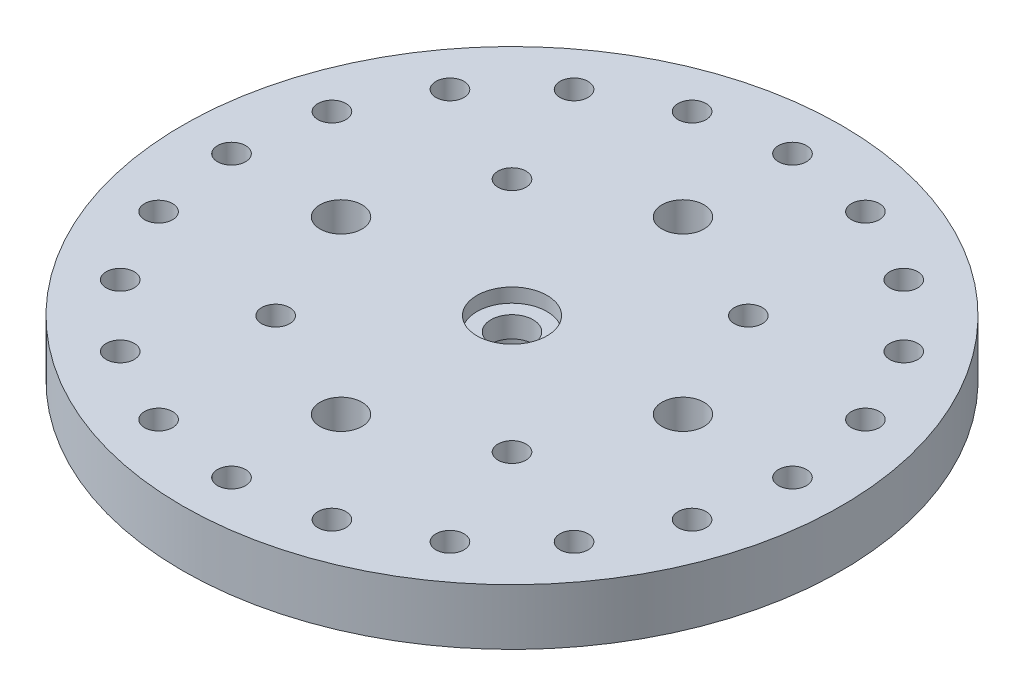
ISO-10303-21;
HEADER;
FILE_DESCRIPTION(('STEP AP214'),'2;1');
FILE_NAME('part.step','',(''),(''),'','','');
FILE_SCHEMA(('AUTOMOTIVE_DESIGN { 1 0 10303 214 1 1 1 1 }'));
ENDSEC;
DATA;
#1=APPLICATION_CONTEXT('core data for automotive mechanical design processes');
#2=APPLICATION_PROTOCOL_DEFINITION('international standard','automotive_design',2000,#1);
#3=PRODUCT_CONTEXT('',#1,'mechanical');
#4=PRODUCT('Part','Part','',(#3));
#5=PRODUCT_RELATED_PRODUCT_CATEGORY('part','',(#4));
#6=PRODUCT_DEFINITION_FORMATION('','',#4);
#7=PRODUCT_DEFINITION_CONTEXT('part definition',#1,'design');
#8=PRODUCT_DEFINITION('design','',#6,#7);
#9=PRODUCT_DEFINITION_SHAPE('','',#8);
#10=(LENGTH_UNIT() NAMED_UNIT(*) SI_UNIT(.MILLI.,.METRE.));
#11=(NAMED_UNIT(*) PLANE_ANGLE_UNIT() SI_UNIT($,.RADIAN.));
#12=(NAMED_UNIT(*) SI_UNIT($,.STERADIAN.) SOLID_ANGLE_UNIT());
#13=UNCERTAINTY_MEASURE_WITH_UNIT(LENGTH_MEASURE(1.E-05),#10,'distance_accuracy_value','');
#14=(GEOMETRIC_REPRESENTATION_CONTEXT(3) GLOBAL_UNCERTAINTY_ASSIGNED_CONTEXT((#13)) GLOBAL_UNIT_ASSIGNED_CONTEXT((#10,
#11,#12)) REPRESENTATION_CONTEXT('',''));
#15=CARTESIAN_POINT('',(0.,0.,0.));
#16=DIRECTION('',(0.,0.,1.));
#17=DIRECTION('',(1.,0.,0.));
#18=AXIS2_PLACEMENT_3D('',#15,#16,#17);
#19=CARTESIAN_POINT('',(0.,0.,0.));
#20=DIRECTION('',(0.,1.,0.));
#21=DIRECTION('',(0.,0.,1.));
#22=AXIS2_PLACEMENT_3D('',#19,#20,#21);
#23=PLANE('',#22);
#24=CARTESIAN_POINT('',(-8.42553379972618,0.,8.4255337997258));
#25=DIRECTION('',(0.,1.,0.));
#26=DIRECTION('',(0.,0.,1.));
#27=AXIS2_PLACEMENT_3D('',#24,#25,#26);
#28=CIRCLE('',#27,1.);
#29=CARTESIAN_POINT('',(-8.42553379972618,0.,9.4255337997258));
#30=VERTEX_POINT('',#29);
#31=EDGE_CURVE('E71',#30,#30,#28,.T.);
#32=ORIENTED_EDGE('',*,*,#31,.T.);
#33=EDGE_LOOP('',(#32));
#34=FACE_BOUND('',#33,.T.);
#35=CARTESIAN_POINT('',(8.42553379972583,0.,8.42553379972615));
#36=DIRECTION('',(0.,1.,0.));
#37=DIRECTION('',(0.,0.,1.));
#38=AXIS2_PLACEMENT_3D('',#35,#36,#37);
#39=CIRCLE('',#38,1.);
#40=CARTESIAN_POINT('',(8.42553379972583,0.,9.42553379972615));
#41=VERTEX_POINT('',#40);
#42=EDGE_CURVE('E94',#41,#41,#39,.T.);
#43=ORIENTED_EDGE('',*,*,#42,.T.);
#44=EDGE_LOOP('',(#43));
#45=FACE_BOUND('',#44,.T.);
#46=CARTESIAN_POINT('',(8.42553379972613,0.,-8.42553379972586));
#47=DIRECTION('',(0.,1.,0.));
#48=DIRECTION('',(0.,0.,1.));
#49=AXIS2_PLACEMENT_3D('',#46,#47,#48);
#50=CIRCLE('',#49,1.);
#51=CARTESIAN_POINT('',(8.42553379972613,0.,-7.42553379972586));
#52=VERTEX_POINT('',#51);
#53=EDGE_CURVE('E100',#52,#52,#50,.T.);
#54=ORIENTED_EDGE('',*,*,#53,.T.);
#55=EDGE_LOOP('',(#54));
#56=FACE_BOUND('',#55,.T.);
#57=CARTESIAN_POINT('',(-12.1919309783954,0.,-1.27703698486593E-13));
#58=DIRECTION('',(0.,1.,0.));
#59=DIRECTION('',(0.,0.,1.));
#60=AXIS2_PLACEMENT_3D('',#57,#58,#59);
#61=CIRCLE('',#60,1.5);
#62=CARTESIAN_POINT('',(-12.1919309783954,0.,1.49999999999987));
#63=VERTEX_POINT('',#62);
#64=EDGE_CURVE('E106',#63,#63,#61,.T.);
#65=ORIENTED_EDGE('',*,*,#64,.T.);
#66=EDGE_LOOP('',(#65));
#67=FACE_BOUND('',#66,.T.);
#68=CARTESIAN_POINT('',(0.,0.,12.1919309783954));
#69=DIRECTION('',(0.,1.,0.));
#70=DIRECTION('',(0.,0.,1.));
#71=AXIS2_PLACEMENT_3D('',#68,#69,#70);
#72=CIRCLE('',#71,1.5);
#73=CARTESIAN_POINT('',(0.,0.,13.6919309783954));
#74=VERTEX_POINT('',#73);
#75=EDGE_CURVE('E112',#74,#74,#72,.T.);
#76=ORIENTED_EDGE('',*,*,#75,.T.);
#77=EDGE_LOOP('',(#76));
#78=FACE_BOUND('',#77,.T.);
#79=CARTESIAN_POINT('',(12.1919309783954,0.,0.));
#80=DIRECTION('',(0.,1.,0.));
#81=DIRECTION('',(0.,0.,1.));
#82=AXIS2_PLACEMENT_3D('',#79,#80,#81);
#83=CIRCLE('',#82,1.5);
#84=CARTESIAN_POINT('',(12.1919309783954,0.,1.50000000000004));
#85=VERTEX_POINT('',#84);
#86=EDGE_CURVE('E118',#85,#85,#83,.T.);
#87=ORIENTED_EDGE('',*,*,#86,.T.);
#88=EDGE_LOOP('',(#87));
#89=FACE_BOUND('',#88,.T.);
#90=CARTESIAN_POINT('',(-8.42553379972589,0.,-8.42553379972609));
#91=DIRECTION('',(0.,1.,0.));
#92=DIRECTION('',(0.,0.,1.));
#93=AXIS2_PLACEMENT_3D('',#90,#91,#92);
#94=CIRCLE('',#93,1.);
#95=CARTESIAN_POINT('',(-8.42553379972589,0.,-7.42553379972609));
#96=VERTEX_POINT('',#95);
#97=EDGE_CURVE('E124',#96,#96,#94,.T.);
#98=ORIENTED_EDGE('',*,*,#97,.T.);
#99=EDGE_LOOP('',(#98));
#100=FACE_BOUND('',#99,.T.);
#101=CARTESIAN_POINT('',(-6.18033988749895,0.,-19.0211303259031));
#102=DIRECTION('',(0.,1.,0.));
#103=DIRECTION('',(0.,0.,1.));
#104=AXIS2_PLACEMENT_3D('',#101,#102,#103);
#105=CIRCLE('',#104,1.);
#106=CARTESIAN_POINT('',(-6.18033988749895,0.,-18.0211303259031));
#107=VERTEX_POINT('',#106);
#108=EDGE_CURVE('E130',#107,#107,#105,.T.);
#109=ORIENTED_EDGE('',*,*,#108,.T.);
#110=EDGE_LOOP('',(#109));
#111=FACE_BOUND('',#110,.T.);
#112=CARTESIAN_POINT('',(-11.7557050458495,0.,-16.1803398874989));
#113=DIRECTION('',(0.,1.,0.));
#114=DIRECTION('',(0.,0.,1.));
#115=AXIS2_PLACEMENT_3D('',#112,#113,#114);
#116=CIRCLE('',#115,1.);
#117=CARTESIAN_POINT('',(-11.7557050458495,0.,-15.1803398874989));
#118=VERTEX_POINT('',#117);
#119=EDGE_CURVE('E136',#118,#118,#116,.T.);
#120=ORIENTED_EDGE('',*,*,#119,.T.);
#121=EDGE_LOOP('',(#120));
#122=FACE_BOUND('',#121,.T.);
#123=CARTESIAN_POINT('',(-16.180339887499,0.,-11.7557050458495));
#124=DIRECTION('',(0.,1.,0.));
#125=DIRECTION('',(0.,0.,1.));
#126=AXIS2_PLACEMENT_3D('',#123,#124,#125);
#127=CIRCLE('',#126,1.);
#128=CARTESIAN_POINT('',(-16.180339887499,0.,-10.7557050458495));
#129=VERTEX_POINT('',#128);
#130=EDGE_CURVE('E142',#129,#129,#127,.T.);
#131=ORIENTED_EDGE('',*,*,#130,.T.);
#132=EDGE_LOOP('',(#131));
#133=FACE_BOUND('',#132,.T.);
#134=CARTESIAN_POINT('',(-19.0211303259031,0.,-6.18033988749894));
#135=DIRECTION('',(0.,1.,0.));
#136=DIRECTION('',(0.,0.,1.));
#137=AXIS2_PLACEMENT_3D('',#134,#135,#136);
#138=CIRCLE('',#137,1.);
#139=CARTESIAN_POINT('',(-19.0211303259031,0.,-5.18033988749894));
#140=VERTEX_POINT('',#139);
#141=EDGE_CURVE('E148',#140,#140,#138,.T.);
#142=ORIENTED_EDGE('',*,*,#141,.T.);
#143=EDGE_LOOP('',(#142));
#144=FACE_BOUND('',#143,.T.);
#145=CARTESIAN_POINT('',(-20.,0.,0.));
#146=DIRECTION('',(0.,1.,0.));
#147=DIRECTION('',(0.,0.,1.));
#148=AXIS2_PLACEMENT_3D('',#145,#146,#147);
#149=CIRCLE('',#148,1.);
#150=CARTESIAN_POINT('',(-20.,0.,1.00000000000001));
#151=VERTEX_POINT('',#150);
#152=EDGE_CURVE('E154',#151,#151,#149,.T.);
#153=ORIENTED_EDGE('',*,*,#152,.T.);
#154=EDGE_LOOP('',(#153));
#155=FACE_BOUND('',#154,.T.);
#156=CARTESIAN_POINT('',(-19.0211303259031,0.,6.18033988749895));
#157=DIRECTION('',(0.,1.,0.));
#158=DIRECTION('',(0.,0.,1.));
#159=AXIS2_PLACEMENT_3D('',#156,#157,#158);
#160=CIRCLE('',#159,0.999999999999998);
#161=CARTESIAN_POINT('',(-19.0211303259031,0.,7.18033988749895));
#162=VERTEX_POINT('',#161);
#163=EDGE_CURVE('E160',#162,#162,#160,.T.);
#164=ORIENTED_EDGE('',*,*,#163,.T.);
#165=EDGE_LOOP('',(#164));
#166=FACE_BOUND('',#165,.T.);
#167=CARTESIAN_POINT('',(-16.1803398874989,0.,11.7557050458495));
#168=DIRECTION('',(0.,1.,0.));
#169=DIRECTION('',(0.,0.,1.));
#170=AXIS2_PLACEMENT_3D('',#167,#168,#169);
#171=CIRCLE('',#170,1.);
#172=CARTESIAN_POINT('',(-16.1803398874989,0.,12.7557050458495));
#173=VERTEX_POINT('',#172);
#174=EDGE_CURVE('E166',#173,#173,#171,.T.);
#175=ORIENTED_EDGE('',*,*,#174,.T.);
#176=EDGE_LOOP('',(#175));
#177=FACE_BOUND('',#176,.T.);
#178=CARTESIAN_POINT('',(-11.7557050458495,0.,16.180339887499));
#179=DIRECTION('',(0.,1.,0.));
#180=DIRECTION('',(0.,0.,1.));
#181=AXIS2_PLACEMENT_3D('',#178,#179,#180);
#182=CIRCLE('',#181,1.);
#183=CARTESIAN_POINT('',(-11.7557050458495,0.,17.180339887499));
#184=VERTEX_POINT('',#183);
#185=EDGE_CURVE('E172',#184,#184,#182,.T.);
#186=ORIENTED_EDGE('',*,*,#185,.T.);
#187=EDGE_LOOP('',(#186));
#188=FACE_BOUND('',#187,.T.);
#189=CARTESIAN_POINT('',(-6.18033988749895,0.,19.0211303259031));
#190=DIRECTION('',(0.,1.,0.));
#191=DIRECTION('',(0.,0.,1.));
#192=AXIS2_PLACEMENT_3D('',#189,#190,#191);
#193=CIRCLE('',#192,1.);
#194=CARTESIAN_POINT('',(-6.18033988749895,0.,20.0211303259031));
#195=VERTEX_POINT('',#194);
#196=EDGE_CURVE('E178',#195,#195,#193,.T.);
#197=ORIENTED_EDGE('',*,*,#196,.T.);
#198=EDGE_LOOP('',(#197));
#199=FACE_BOUND('',#198,.T.);
#200=CARTESIAN_POINT('',(0.,0.,20.));
#201=DIRECTION('',(0.,1.,0.));
#202=DIRECTION('',(0.,0.,1.));
#203=AXIS2_PLACEMENT_3D('',#200,#201,#202);
#204=CIRCLE('',#203,1.);
#205=CARTESIAN_POINT('',(0.,0.,21.));
#206=VERTEX_POINT('',#205);
#207=EDGE_CURVE('E184',#206,#206,#204,.T.);
#208=ORIENTED_EDGE('',*,*,#207,.T.);
#209=EDGE_LOOP('',(#208));
#210=FACE_BOUND('',#209,.T.);
#211=CARTESIAN_POINT('',(6.18033988749895,0.,19.0211303259031));
#212=DIRECTION('',(0.,1.,0.));
#213=DIRECTION('',(0.,0.,1.));
#214=AXIS2_PLACEMENT_3D('',#211,#212,#213);
#215=CIRCLE('',#214,1.);
#216=CARTESIAN_POINT('',(6.18033988749895,0.,20.0211303259031));
#217=VERTEX_POINT('',#216);
#218=EDGE_CURVE('E190',#217,#217,#215,.T.);
#219=ORIENTED_EDGE('',*,*,#218,.T.);
#220=EDGE_LOOP('',(#219));
#221=FACE_BOUND('',#220,.T.);
#222=CARTESIAN_POINT('',(11.7557050458495,0.,16.1803398874989));
#223=DIRECTION('',(0.,1.,0.));
#224=DIRECTION('',(0.,0.,1.));
#225=AXIS2_PLACEMENT_3D('',#222,#223,#224);
#226=CIRCLE('',#225,1.);
#227=CARTESIAN_POINT('',(11.7557050458495,0.,17.1803398874989));
#228=VERTEX_POINT('',#227);
#229=EDGE_CURVE('E196',#228,#228,#226,.T.);
#230=ORIENTED_EDGE('',*,*,#229,.T.);
#231=EDGE_LOOP('',(#230));
#232=FACE_BOUND('',#231,.T.);
#233=CARTESIAN_POINT('',(16.180339887499,0.,11.7557050458495));
#234=DIRECTION('',(0.,1.,0.));
#235=DIRECTION('',(0.,0.,1.));
#236=AXIS2_PLACEMENT_3D('',#233,#234,#235);
#237=CIRCLE('',#236,1.00000000000001);
#238=CARTESIAN_POINT('',(16.180339887499,0.,12.7557050458495));
#239=VERTEX_POINT('',#238);
#240=EDGE_CURVE('E202',#239,#239,#237,.T.);
#241=ORIENTED_EDGE('',*,*,#240,.T.);
#242=EDGE_LOOP('',(#241));
#243=FACE_BOUND('',#242,.T.);
#244=CARTESIAN_POINT('',(19.0211303259031,0.,6.18033988749895));
#245=DIRECTION('',(0.,1.,0.));
#246=DIRECTION('',(0.,0.,1.));
#247=AXIS2_PLACEMENT_3D('',#244,#245,#246);
#248=CIRCLE('',#247,1.);
#249=CARTESIAN_POINT('',(19.0211303259031,0.,7.18033988749895));
#250=VERTEX_POINT('',#249);
#251=EDGE_CURVE('E208',#250,#250,#248,.T.);
#252=ORIENTED_EDGE('',*,*,#251,.T.);
#253=EDGE_LOOP('',(#252));
#254=FACE_BOUND('',#253,.T.);
#255=CARTESIAN_POINT('',(20.,0.,0.));
#256=DIRECTION('',(0.,1.,0.));
#257=DIRECTION('',(0.,0.,1.));
#258=AXIS2_PLACEMENT_3D('',#255,#256,#257);
#259=CIRCLE('',#258,1.);
#260=CARTESIAN_POINT('',(20.,0.,1.));
#261=VERTEX_POINT('',#260);
#262=EDGE_CURVE('E214',#261,#261,#259,.T.);
#263=ORIENTED_EDGE('',*,*,#262,.T.);
#264=EDGE_LOOP('',(#263));
#265=FACE_BOUND('',#264,.T.);
#266=CARTESIAN_POINT('',(19.0211303259031,0.,-6.18033988749895));
#267=DIRECTION('',(0.,1.,0.));
#268=DIRECTION('',(0.,0.,1.));
#269=AXIS2_PLACEMENT_3D('',#266,#267,#268);
#270=CIRCLE('',#269,1.);
#271=CARTESIAN_POINT('',(19.0211303259031,0.,-5.18033988749895));
#272=VERTEX_POINT('',#271);
#273=EDGE_CURVE('E220',#272,#272,#270,.T.);
#274=ORIENTED_EDGE('',*,*,#273,.T.);
#275=EDGE_LOOP('',(#274));
#276=FACE_BOUND('',#275,.T.);
#277=CARTESIAN_POINT('',(16.180339887499,0.,-11.7557050458495));
#278=DIRECTION('',(0.,1.,0.));
#279=DIRECTION('',(0.,0.,1.));
#280=AXIS2_PLACEMENT_3D('',#277,#278,#279);
#281=CIRCLE('',#280,1.00000000000001);
#282=CARTESIAN_POINT('',(16.180339887499,0.,-10.7557050458495));
#283=VERTEX_POINT('',#282);
#284=EDGE_CURVE('E226',#283,#283,#281,.T.);
#285=ORIENTED_EDGE('',*,*,#284,.T.);
#286=EDGE_LOOP('',(#285));
#287=FACE_BOUND('',#286,.T.);
#288=CARTESIAN_POINT('',(11.7557050458495,0.,-16.180339887499));
#289=DIRECTION('',(0.,1.,0.));
#290=DIRECTION('',(0.,0.,1.));
#291=AXIS2_PLACEMENT_3D('',#288,#289,#290);
#292=CIRCLE('',#291,1.);
#293=CARTESIAN_POINT('',(11.7557050458495,0.,-15.1803398874989));
#294=VERTEX_POINT('',#293);
#295=EDGE_CURVE('E232',#294,#294,#292,.T.);
#296=ORIENTED_EDGE('',*,*,#295,.T.);
#297=EDGE_LOOP('',(#296));
#298=FACE_BOUND('',#297,.T.);
#299=CARTESIAN_POINT('',(6.18033988749895,0.,-19.0211303259031));
#300=DIRECTION('',(0.,1.,0.));
#301=DIRECTION('',(0.,0.,1.));
#302=AXIS2_PLACEMENT_3D('',#299,#300,#301);
#303=CIRCLE('',#302,1.);
#304=CARTESIAN_POINT('',(6.18033988749895,0.,-18.0211303259031));
#305=VERTEX_POINT('',#304);
#306=EDGE_CURVE('E238',#305,#305,#303,.T.);
#307=ORIENTED_EDGE('',*,*,#306,.T.);
#308=EDGE_LOOP('',(#307));
#309=FACE_BOUND('',#308,.T.);
#310=CARTESIAN_POINT('',(0.,0.,-12.1919309783954));
#311=DIRECTION('',(0.,1.,0.));
#312=DIRECTION('',(0.,0.,1.));
#313=AXIS2_PLACEMENT_3D('',#310,#311,#312);
#314=CIRCLE('',#313,1.5);
#315=CARTESIAN_POINT('',(0.,0.,-10.6919309783954));
#316=VERTEX_POINT('',#315);
#317=EDGE_CURVE('E244',#316,#316,#314,.T.);
#318=ORIENTED_EDGE('',*,*,#317,.T.);
#319=EDGE_LOOP('',(#318));
#320=FACE_BOUND('',#319,.T.);
#321=CARTESIAN_POINT('',(0.,0.,-20.));
#322=DIRECTION('',(0.,1.,0.));
#323=DIRECTION('',(0.,0.,1.));
#324=AXIS2_PLACEMENT_3D('',#321,#322,#323);
#325=CIRCLE('',#324,1.);
#326=CARTESIAN_POINT('',(0.,0.,-19.));
#327=VERTEX_POINT('',#326);
#328=EDGE_CURVE('E66',#327,#327,#325,.T.);
#329=ORIENTED_EDGE('',*,*,#328,.T.);
#330=EDGE_LOOP('',(#329));
#331=FACE_BOUND('',#330,.T.);
#332=CARTESIAN_POINT('',(0.,0.,0.));
#333=DIRECTION('',(0.,1.,0.));
#334=DIRECTION('',(0.,0.,1.));
#335=AXIS2_PLACEMENT_3D('',#332,#333,#334);
#336=CIRCLE('',#335,23.5);
#337=CARTESIAN_POINT('',(0.,0.,23.5));
#338=VERTEX_POINT('',#337);
#339=EDGE_CURVE('E58',#338,#338,#336,.T.);
#340=ORIENTED_EDGE('',*,*,#339,.F.);
#341=EDGE_LOOP('',(#340));
#342=FACE_BOUND('',#341,.T.);
#343=CARTESIAN_POINT('',(0.,0.,0.));
#344=DIRECTION('',(0.,1.,0.));
#345=DIRECTION('',(0.,0.,1.));
#346=AXIS2_PLACEMENT_3D('',#343,#344,#345);
#347=CIRCLE('',#346,3.7);
#348=CARTESIAN_POINT('',(0.,0.,3.7));
#349=VERTEX_POINT('',#348);
#350=EDGE_CURVE('E11',#349,#349,#347,.F.);
#351=ORIENTED_EDGE('',*,*,#350,.F.);
#352=EDGE_LOOP('',(#351));
#353=FACE_BOUND('',#352,.T.);
#354=ADVANCED_FACE('F47',(#34,#45,#56,#67,#78,#89,#100,#111,#122,#133,#144,#155,#166,#177,#188,
#199,#210,#221,#232,#243,#254,#265,#276,#287,#298,#309,#320,#331,#342,#353),#23,.F.);
#355=CARTESIAN_POINT('',(0.,4.,0.));
#356=DIRECTION('',(0.,-1.,0.));
#357=DIRECTION('',(0.,0.,-1.));
#358=AXIS2_PLACEMENT_3D('',#355,#356,#357);
#359=CYLINDRICAL_SURFACE('',#358,1.5);
#360=CARTESIAN_POINT('',(0.,1.5,0.));
#361=DIRECTION('',(0.,-1.,0.));
#362=DIRECTION('',(0.,0.,-1.));
#363=AXIS2_PLACEMENT_3D('',#360,#361,#362);
#364=CIRCLE('',#363,1.5);
#365=CARTESIAN_POINT('',(0.,1.5,-1.5));
#366=VERTEX_POINT('',#365);
#367=EDGE_CURVE('E69',#366,#366,#364,.T.);
#368=ORIENTED_EDGE('',*,*,#367,.T.);
#369=EDGE_LOOP('',(#368));
#370=FACE_BOUND('',#369,.T.);
#371=CARTESIAN_POINT('',(0.,3.,0.));
#372=DIRECTION('',(0.,1.,0.));
#373=DIRECTION('',(0.,0.,1.));
#374=AXIS2_PLACEMENT_3D('',#371,#372,#373);
#375=CIRCLE('',#374,1.5);
#376=CARTESIAN_POINT('',(0.,3.,1.5));
#377=VERTEX_POINT('',#376);
#378=EDGE_CURVE('E73',#377,#377,#375,.T.);
#379=ORIENTED_EDGE('',*,*,#378,.T.);
#380=EDGE_LOOP('',(#379));
#381=FACE_BOUND('',#380,.T.);
#382=ADVANCED_FACE('F274',(#370,#381),#359,.F.);
#383=CARTESIAN_POINT('',(0.,4.,0.));
#384=DIRECTION('',(0.,1.,0.));
#385=DIRECTION('',(0.,0.,1.));
#386=AXIS2_PLACEMENT_3D('',#383,#384,#385);
#387=PLANE('',#386);
#388=CARTESIAN_POINT('',(0.,4.,0.));
#389=DIRECTION('',(0.,1.,0.));
#390=DIRECTION('',(0.,0.,1.));
#391=AXIS2_PLACEMENT_3D('',#388,#389,#390);
#392=CIRCLE('',#391,2.5);
#393=CARTESIAN_POINT('',(0.,4.,2.5));
#394=VERTEX_POINT('',#393);
#395=EDGE_CURVE('E81',#394,#394,#392,.T.);
#396=ORIENTED_EDGE('',*,*,#395,.F.);
#397=EDGE_LOOP('',(#396));
#398=FACE_BOUND('',#397,.T.);
#399=CARTESIAN_POINT('',(8.42553379972583,4.,8.42553379972615));
#400=DIRECTION('',(0.,1.,0.));
#401=DIRECTION('',(0.,0.,1.));
#402=AXIS2_PLACEMENT_3D('',#399,#400,#401);
#403=CIRCLE('',#402,1.);
#404=CARTESIAN_POINT('',(8.42553379972583,4.,9.42553379972615));
#405=VERTEX_POINT('',#404);
#406=EDGE_CURVE('E97',#405,#405,#403,.T.);
#407=ORIENTED_EDGE('',*,*,#406,.F.);
#408=EDGE_LOOP('',(#407));
#409=FACE_BOUND('',#408,.T.);
#410=CARTESIAN_POINT('',(-12.1919309783954,4.,-1.27703698486593E-13));
#411=DIRECTION('',(0.,1.,0.));
#412=DIRECTION('',(0.,0.,1.));
#413=AXIS2_PLACEMENT_3D('',#410,#411,#412);
#414=CIRCLE('',#413,1.5);
#415=CARTESIAN_POINT('',(-12.1919309783954,4.,1.49999999999987));
#416=VERTEX_POINT('',#415);
#417=EDGE_CURVE('E109',#416,#416,#414,.T.);
#418=ORIENTED_EDGE('',*,*,#417,.F.);
#419=EDGE_LOOP('',(#418));
#420=FACE_BOUND('',#419,.T.);
#421=CARTESIAN_POINT('',(12.1919309783954,4.,0.));
#422=DIRECTION('',(0.,1.,0.));
#423=DIRECTION('',(0.,0.,1.));
#424=AXIS2_PLACEMENT_3D('',#421,#422,#423);
#425=CIRCLE('',#424,1.5);
#426=CARTESIAN_POINT('',(12.1919309783954,4.,1.50000000000004));
#427=VERTEX_POINT('',#426);
#428=EDGE_CURVE('E121',#427,#427,#425,.T.);
#429=ORIENTED_EDGE('',*,*,#428,.F.);
#430=EDGE_LOOP('',(#429));
#431=FACE_BOUND('',#430,.T.);
#432=CARTESIAN_POINT('',(-6.18033988749895,4.,-19.0211303259031));
#433=DIRECTION('',(0.,1.,0.));
#434=DIRECTION('',(0.,0.,1.));
#435=AXIS2_PLACEMENT_3D('',#432,#433,#434);
#436=CIRCLE('',#435,1.);
#437=CARTESIAN_POINT('',(-6.18033988749895,4.,-18.0211303259031));
#438=VERTEX_POINT('',#437);
#439=EDGE_CURVE('E133',#438,#438,#436,.T.);
#440=ORIENTED_EDGE('',*,*,#439,.F.);
#441=EDGE_LOOP('',(#440));
#442=FACE_BOUND('',#441,.T.);
#443=CARTESIAN_POINT('',(-16.180339887499,4.,-11.7557050458495));
#444=DIRECTION('',(0.,1.,0.));
#445=DIRECTION('',(0.,0.,1.));
#446=AXIS2_PLACEMENT_3D('',#443,#444,#445);
#447=CIRCLE('',#446,1.);
#448=CARTESIAN_POINT('',(-16.180339887499,4.,-10.7557050458495));
#449=VERTEX_POINT('',#448);
#450=EDGE_CURVE('E145',#449,#449,#447,.T.);
#451=ORIENTED_EDGE('',*,*,#450,.F.);
#452=EDGE_LOOP('',(#451));
#453=FACE_BOUND('',#452,.T.);
#454=CARTESIAN_POINT('',(-20.,4.,0.));
#455=DIRECTION('',(0.,1.,0.));
#456=DIRECTION('',(0.,0.,1.));
#457=AXIS2_PLACEMENT_3D('',#454,#455,#456);
#458=CIRCLE('',#457,1.);
#459=CARTESIAN_POINT('',(-20.,4.,1.00000000000001));
#460=VERTEX_POINT('',#459);
#461=EDGE_CURVE('E157',#460,#460,#458,.T.);
#462=ORIENTED_EDGE('',*,*,#461,.F.);
#463=EDGE_LOOP('',(#462));
#464=FACE_BOUND('',#463,.T.);
#465=CARTESIAN_POINT('',(-16.1803398874989,4.,11.7557050458495));
#466=DIRECTION('',(0.,1.,0.));
#467=DIRECTION('',(0.,0.,1.));
#468=AXIS2_PLACEMENT_3D('',#465,#466,#467);
#469=CIRCLE('',#468,1.);
#470=CARTESIAN_POINT('',(-16.1803398874989,4.,12.7557050458495));
#471=VERTEX_POINT('',#470);
#472=EDGE_CURVE('E169',#471,#471,#469,.T.);
#473=ORIENTED_EDGE('',*,*,#472,.F.);
#474=EDGE_LOOP('',(#473));
#475=FACE_BOUND('',#474,.T.);
#476=CARTESIAN_POINT('',(-6.18033988749895,4.,19.0211303259031));
#477=DIRECTION('',(0.,1.,0.));
#478=DIRECTION('',(0.,0.,1.));
#479=AXIS2_PLACEMENT_3D('',#476,#477,#478);
#480=CIRCLE('',#479,1.);
#481=CARTESIAN_POINT('',(-6.18033988749895,4.,20.0211303259031));
#482=VERTEX_POINT('',#481);
#483=EDGE_CURVE('E181',#482,#482,#480,.T.);
#484=ORIENTED_EDGE('',*,*,#483,.F.);
#485=EDGE_LOOP('',(#484));
#486=FACE_BOUND('',#485,.T.);
#487=CARTESIAN_POINT('',(6.18033988749895,4.,19.0211303259031));
#488=DIRECTION('',(0.,1.,0.));
#489=DIRECTION('',(0.,0.,1.));
#490=AXIS2_PLACEMENT_3D('',#487,#488,#489);
#491=CIRCLE('',#490,1.);
#492=CARTESIAN_POINT('',(6.18033988749895,4.,20.0211303259031));
#493=VERTEX_POINT('',#492);
#494=EDGE_CURVE('E193',#493,#493,#491,.T.);
#495=ORIENTED_EDGE('',*,*,#494,.F.);
#496=EDGE_LOOP('',(#495));
#497=FACE_BOUND('',#496,.T.);
#498=CARTESIAN_POINT('',(16.180339887499,4.,11.7557050458495));
#499=DIRECTION('',(0.,1.,0.));
#500=DIRECTION('',(0.,0.,1.));
#501=AXIS2_PLACEMENT_3D('',#498,#499,#500);
#502=CIRCLE('',#501,1.00000000000001);
#503=CARTESIAN_POINT('',(16.180339887499,4.,12.7557050458495));
#504=VERTEX_POINT('',#503);
#505=EDGE_CURVE('E205',#504,#504,#502,.T.);
#506=ORIENTED_EDGE('',*,*,#505,.F.);
#507=EDGE_LOOP('',(#506));
#508=FACE_BOUND('',#507,.T.);
#509=CARTESIAN_POINT('',(20.,4.,0.));
#510=DIRECTION('',(0.,1.,0.));
#511=DIRECTION('',(0.,0.,1.));
#512=AXIS2_PLACEMENT_3D('',#509,#510,#511);
#513=CIRCLE('',#512,1.);
#514=CARTESIAN_POINT('',(20.,4.,1.));
#515=VERTEX_POINT('',#514);
#516=EDGE_CURVE('E217',#515,#515,#513,.T.);
#517=ORIENTED_EDGE('',*,*,#516,.F.);
#518=EDGE_LOOP('',(#517));
#519=FACE_BOUND('',#518,.T.);
#520=CARTESIAN_POINT('',(16.180339887499,4.,-11.7557050458495));
#521=DIRECTION('',(0.,1.,0.));
#522=DIRECTION('',(0.,0.,1.));
#523=AXIS2_PLACEMENT_3D('',#520,#521,#522);
#524=CIRCLE('',#523,1.00000000000001);
#525=CARTESIAN_POINT('',(16.180339887499,4.,-10.7557050458495));
#526=VERTEX_POINT('',#525);
#527=EDGE_CURVE('E229',#526,#526,#524,.T.);
#528=ORIENTED_EDGE('',*,*,#527,.F.);
#529=EDGE_LOOP('',(#528));
#530=FACE_BOUND('',#529,.T.);
#531=CARTESIAN_POINT('',(6.18033988749895,4.,-19.0211303259031));
#532=DIRECTION('',(0.,1.,0.));
#533=DIRECTION('',(0.,0.,1.));
#534=AXIS2_PLACEMENT_3D('',#531,#532,#533);
#535=CIRCLE('',#534,1.);
#536=CARTESIAN_POINT('',(6.18033988749895,4.,-18.0211303259031));
#537=VERTEX_POINT('',#536);
#538=EDGE_CURVE('E241',#537,#537,#535,.T.);
#539=ORIENTED_EDGE('',*,*,#538,.F.);
#540=EDGE_LOOP('',(#539));
#541=FACE_BOUND('',#540,.T.);
#542=CARTESIAN_POINT('',(0.,4.,-20.));
#543=DIRECTION('',(0.,1.,0.));
#544=DIRECTION('',(0.,0.,1.));
#545=AXIS2_PLACEMENT_3D('',#542,#543,#544);
#546=CIRCLE('',#545,1.);
#547=CARTESIAN_POINT('',(0.,4.,-19.));
#548=VERTEX_POINT('',#547);
#549=EDGE_CURVE('E63',#548,#548,#546,.T.);
#550=ORIENTED_EDGE('',*,*,#549,.F.);
#551=EDGE_LOOP('',(#550));
#552=FACE_BOUND('',#551,.T.);
#553=CARTESIAN_POINT('',(0.,4.,0.));
#554=DIRECTION('',(0.,1.,0.));
#555=DIRECTION('',(0.,0.,1.));
#556=AXIS2_PLACEMENT_3D('',#553,#554,#555);
#557=CIRCLE('',#556,23.5);
#558=CARTESIAN_POINT('',(0.,4.,23.5));
#559=VERTEX_POINT('',#558);
#560=EDGE_CURVE('E54',#559,#559,#557,.T.);
#561=ORIENTED_EDGE('',*,*,#560,.T.);
#562=EDGE_LOOP('',(#561));
#563=FACE_BOUND('',#562,.T.);
#564=CARTESIAN_POINT('',(0.,4.,-12.1919309783954));
#565=DIRECTION('',(0.,1.,0.));
#566=DIRECTION('',(0.,0.,1.));
#567=AXIS2_PLACEMENT_3D('',#564,#565,#566);
#568=CIRCLE('',#567,1.5);
#569=CARTESIAN_POINT('',(0.,4.,-10.6919309783954));
#570=VERTEX_POINT('',#569);
#571=EDGE_CURVE('E247',#570,#570,#568,.T.);
#572=ORIENTED_EDGE('',*,*,#571,.F.);
#573=EDGE_LOOP('',(#572));
#574=FACE_BOUND('',#573,.T.);
#575=CARTESIAN_POINT('',(11.7557050458495,4.,-16.180339887499));
#576=DIRECTION('',(0.,1.,0.));
#577=DIRECTION('',(0.,0.,1.));
#578=AXIS2_PLACEMENT_3D('',#575,#576,#577);
#579=CIRCLE('',#578,1.);
#580=CARTESIAN_POINT('',(11.7557050458495,4.,-15.1803398874989));
#581=VERTEX_POINT('',#580);
#582=EDGE_CURVE('E235',#581,#581,#579,.T.);
#583=ORIENTED_EDGE('',*,*,#582,.F.);
#584=EDGE_LOOP('',(#583));
#585=FACE_BOUND('',#584,.T.);
#586=CARTESIAN_POINT('',(19.0211303259031,4.,-6.18033988749895));
#587=DIRECTION('',(0.,1.,0.));
#588=DIRECTION('',(0.,0.,1.));
#589=AXIS2_PLACEMENT_3D('',#586,#587,#588);
#590=CIRCLE('',#589,1.);
#591=CARTESIAN_POINT('',(19.0211303259031,4.,-5.18033988749895));
#592=VERTEX_POINT('',#591);
#593=EDGE_CURVE('E223',#592,#592,#590,.T.);
#594=ORIENTED_EDGE('',*,*,#593,.F.);
#595=EDGE_LOOP('',(#594));
#596=FACE_BOUND('',#595,.T.);
#597=CARTESIAN_POINT('',(19.0211303259031,4.,6.18033988749895));
#598=DIRECTION('',(0.,1.,0.));
#599=DIRECTION('',(0.,0.,1.));
#600=AXIS2_PLACEMENT_3D('',#597,#598,#599);
#601=CIRCLE('',#600,1.);
#602=CARTESIAN_POINT('',(19.0211303259031,4.,7.18033988749895));
#603=VERTEX_POINT('',#602);
#604=EDGE_CURVE('E211',#603,#603,#601,.T.);
#605=ORIENTED_EDGE('',*,*,#604,.F.);
#606=EDGE_LOOP('',(#605));
#607=FACE_BOUND('',#606,.T.);
#608=CARTESIAN_POINT('',(11.7557050458495,4.,16.1803398874989));
#609=DIRECTION('',(0.,1.,0.));
#610=DIRECTION('',(0.,0.,1.));
#611=AXIS2_PLACEMENT_3D('',#608,#609,#610);
#612=CIRCLE('',#611,1.);
#613=CARTESIAN_POINT('',(11.7557050458495,4.,17.1803398874989));
#614=VERTEX_POINT('',#613);
#615=EDGE_CURVE('E199',#614,#614,#612,.T.);
#616=ORIENTED_EDGE('',*,*,#615,.F.);
#617=EDGE_LOOP('',(#616));
#618=FACE_BOUND('',#617,.T.);
#619=CARTESIAN_POINT('',(0.,4.,20.));
#620=DIRECTION('',(0.,1.,0.));
#621=DIRECTION('',(0.,0.,1.));
#622=AXIS2_PLACEMENT_3D('',#619,#620,#621);
#623=CIRCLE('',#622,1.);
#624=CARTESIAN_POINT('',(0.,4.,21.));
#625=VERTEX_POINT('',#624);
#626=EDGE_CURVE('E187',#625,#625,#623,.T.);
#627=ORIENTED_EDGE('',*,*,#626,.F.);
#628=EDGE_LOOP('',(#627));
#629=FACE_BOUND('',#628,.T.);
#630=CARTESIAN_POINT('',(-11.7557050458495,4.,16.180339887499));
#631=DIRECTION('',(0.,1.,0.));
#632=DIRECTION('',(0.,0.,1.));
#633=AXIS2_PLACEMENT_3D('',#630,#631,#632);
#634=CIRCLE('',#633,1.);
#635=CARTESIAN_POINT('',(-11.7557050458495,4.,17.180339887499));
#636=VERTEX_POINT('',#635);
#637=EDGE_CURVE('E175',#636,#636,#634,.T.);
#638=ORIENTED_EDGE('',*,*,#637,.F.);
#639=EDGE_LOOP('',(#638));
#640=FACE_BOUND('',#639,.T.);
#641=CARTESIAN_POINT('',(-19.0211303259031,4.,6.18033988749895));
#642=DIRECTION('',(0.,1.,0.));
#643=DIRECTION('',(0.,0.,1.));
#644=AXIS2_PLACEMENT_3D('',#641,#642,#643);
#645=CIRCLE('',#644,0.999999999999998);
#646=CARTESIAN_POINT('',(-19.0211303259031,4.,7.18033988749895));
#647=VERTEX_POINT('',#646);
#648=EDGE_CURVE('E163',#647,#647,#645,.T.);
#649=ORIENTED_EDGE('',*,*,#648,.F.);
#650=EDGE_LOOP('',(#649));
#651=FACE_BOUND('',#650,.T.);
#652=CARTESIAN_POINT('',(-19.0211303259031,4.,-6.18033988749894));
#653=DIRECTION('',(0.,1.,0.));
#654=DIRECTION('',(0.,0.,1.));
#655=AXIS2_PLACEMENT_3D('',#652,#653,#654);
#656=CIRCLE('',#655,1.);
#657=CARTESIAN_POINT('',(-19.0211303259031,4.,-5.18033988749894));
#658=VERTEX_POINT('',#657);
#659=EDGE_CURVE('E151',#658,#658,#656,.T.);
#660=ORIENTED_EDGE('',*,*,#659,.F.);
#661=EDGE_LOOP('',(#660));
#662=FACE_BOUND('',#661,.T.);
#663=CARTESIAN_POINT('',(-11.7557050458495,4.,-16.1803398874989));
#664=DIRECTION('',(0.,1.,0.));
#665=DIRECTION('',(0.,0.,1.));
#666=AXIS2_PLACEMENT_3D('',#663,#664,#665);
#667=CIRCLE('',#666,1.);
#668=CARTESIAN_POINT('',(-11.7557050458495,4.,-15.1803398874989));
#669=VERTEX_POINT('',#668);
#670=EDGE_CURVE('E139',#669,#669,#667,.T.);
#671=ORIENTED_EDGE('',*,*,#670,.F.);
#672=EDGE_LOOP('',(#671));
#673=FACE_BOUND('',#672,.T.);
#674=CARTESIAN_POINT('',(-8.42553379972589,4.,-8.42553379972609));
#675=DIRECTION('',(0.,1.,0.));
#676=DIRECTION('',(0.,0.,1.));
#677=AXIS2_PLACEMENT_3D('',#674,#675,#676);
#678=CIRCLE('',#677,1.);
#679=CARTESIAN_POINT('',(-8.42553379972589,4.,-7.42553379972609));
#680=VERTEX_POINT('',#679);
#681=EDGE_CURVE('E127',#680,#680,#678,.T.);
#682=ORIENTED_EDGE('',*,*,#681,.F.);
#683=EDGE_LOOP('',(#682));
#684=FACE_BOUND('',#683,.T.);
#685=CARTESIAN_POINT('',(0.,4.,12.1919309783954));
#686=DIRECTION('',(0.,1.,0.));
#687=DIRECTION('',(0.,0.,1.));
#688=AXIS2_PLACEMENT_3D('',#685,#686,#687);
#689=CIRCLE('',#688,1.5);
#690=CARTESIAN_POINT('',(0.,4.,13.6919309783954));
#691=VERTEX_POINT('',#690);
#692=EDGE_CURVE('E115',#691,#691,#689,.T.);
#693=ORIENTED_EDGE('',*,*,#692,.F.);
#694=EDGE_LOOP('',(#693));
#695=FACE_BOUND('',#694,.T.);
#696=CARTESIAN_POINT('',(8.42553379972613,4.,-8.42553379972586));
#697=DIRECTION('',(0.,1.,0.));
#698=DIRECTION('',(0.,0.,1.));
#699=AXIS2_PLACEMENT_3D('',#696,#697,#698);
#700=CIRCLE('',#699,1.);
#701=CARTESIAN_POINT('',(8.42553379972613,4.,-7.42553379972586));
#702=VERTEX_POINT('',#701);
#703=EDGE_CURVE('E103',#702,#702,#700,.T.);
#704=ORIENTED_EDGE('',*,*,#703,.F.);
#705=EDGE_LOOP('',(#704));
#706=FACE_BOUND('',#705,.T.);
#707=CARTESIAN_POINT('',(-8.42553379972618,4.,8.4255337997258));
#708=DIRECTION('',(0.,1.,0.));
#709=DIRECTION('',(0.,0.,1.));
#710=AXIS2_PLACEMENT_3D('',#707,#708,#709);
#711=CIRCLE('',#710,1.);
#712=CARTESIAN_POINT('',(-8.42553379972618,4.,9.4255337997258));
#713=VERTEX_POINT('',#712);
#714=EDGE_CURVE('E91',#713,#713,#711,.T.);
#715=ORIENTED_EDGE('',*,*,#714,.F.);
#716=EDGE_LOOP('',(#715));
#717=FACE_BOUND('',#716,.T.);
#718=ADVANCED_FACE('F270',(#398,#409,#420,#431,#442,#453,#464,#475,#486,#497,#508,#519,#530,
#541,#552,#563,#574,#585,#596,#607,#618,#629,#640,#651,#662,#673,#684,#695,#706,#717),#387,.T.);
#719=CARTESIAN_POINT('',(0.,4.,0.));
#720=DIRECTION('',(0.,-1.,0.));
#721=DIRECTION('',(0.,0.,-1.));
#722=AXIS2_PLACEMENT_3D('',#719,#720,#721);
#723=CYLINDRICAL_SURFACE('',#722,23.5);
#724=ORIENTED_EDGE('',*,*,#560,.F.);
#725=EDGE_LOOP('',(#724));
#726=FACE_BOUND('',#725,.T.);
#727=ORIENTED_EDGE('',*,*,#339,.T.);
#728=EDGE_LOOP('',(#727));
#729=FACE_BOUND('',#728,.T.);
#730=ADVANCED_FACE('F49',(#726,#729),#723,.T.);
#731=CARTESIAN_POINT('',(0.,4.,-20.));
#732=DIRECTION('',(0.,-1.,0.));
#733=DIRECTION('',(0.,0.,-1.));
#734=AXIS2_PLACEMENT_3D('',#731,#732,#733);
#735=CYLINDRICAL_SURFACE('',#734,1.);
#736=ORIENTED_EDGE('',*,*,#549,.T.);
#737=EDGE_LOOP('',(#736));
#738=FACE_BOUND('',#737,.T.);
#739=ORIENTED_EDGE('',*,*,#328,.F.);
#740=EDGE_LOOP('',(#739));
#741=FACE_BOUND('',#740,.T.);
#742=ADVANCED_FACE('F259',(#738,#741),#735,.F.);
#743=CARTESIAN_POINT('',(0.,4.,-12.1919309783954));
#744=DIRECTION('',(0.,-1.,0.));
#745=DIRECTION('',(0.,0.,-1.));
#746=AXIS2_PLACEMENT_3D('',#743,#744,#745);
#747=CYLINDRICAL_SURFACE('',#746,1.5);
#748=ORIENTED_EDGE('',*,*,#571,.T.);
#749=EDGE_LOOP('',(#748));
#750=FACE_BOUND('',#749,.T.);
#751=ORIENTED_EDGE('',*,*,#317,.F.);
#752=EDGE_LOOP('',(#751));
#753=FACE_BOUND('',#752,.T.);
#754=ADVANCED_FACE('F261',(#750,#753),#747,.F.);
#755=CARTESIAN_POINT('',(6.18033988749895,4.,-19.0211303259031));
#756=DIRECTION('',(0.,-1.,0.));
#757=DIRECTION('',(0.,0.,-1.));
#758=AXIS2_PLACEMENT_3D('',#755,#756,#757);
#759=CYLINDRICAL_SURFACE('',#758,1.);
#760=ORIENTED_EDGE('',*,*,#538,.T.);
#761=EDGE_LOOP('',(#760));
#762=FACE_BOUND('',#761,.T.);
#763=ORIENTED_EDGE('',*,*,#306,.F.);
#764=EDGE_LOOP('',(#763));
#765=FACE_BOUND('',#764,.T.);
#766=ADVANCED_FACE('F267',(#762,#765),#759,.F.);
#767=CARTESIAN_POINT('',(11.7557050458495,4.,-16.180339887499));
#768=DIRECTION('',(0.,-1.,0.));
#769=DIRECTION('',(0.,0.,-1.));
#770=AXIS2_PLACEMENT_3D('',#767,#768,#769);
#771=CYLINDRICAL_SURFACE('',#770,1.);
#772=ORIENTED_EDGE('',*,*,#582,.T.);
#773=EDGE_LOOP('',(#772));
#774=FACE_BOUND('',#773,.T.);
#775=ORIENTED_EDGE('',*,*,#295,.F.);
#776=EDGE_LOOP('',(#775));
#777=FACE_BOUND('',#776,.T.);
#778=ADVANCED_FACE('F451',(#774,#777),#771,.F.);
#779=CARTESIAN_POINT('',(16.180339887499,4.,-11.7557050458495));
#780=DIRECTION('',(0.,-1.,0.));
#781=DIRECTION('',(0.,0.,-1.));
#782=AXIS2_PLACEMENT_3D('',#779,#780,#781);
#783=CYLINDRICAL_SURFACE('',#782,1.00000000000001);
#784=ORIENTED_EDGE('',*,*,#527,.T.);
#785=EDGE_LOOP('',(#784));
#786=FACE_BOUND('',#785,.T.);
#787=ORIENTED_EDGE('',*,*,#284,.F.);
#788=EDGE_LOOP('',(#787));
#789=FACE_BOUND('',#788,.T.);
#790=ADVANCED_FACE('F447',(#786,#789),#783,.F.);
#791=CARTESIAN_POINT('',(19.0211303259031,4.,-6.18033988749895));
#792=DIRECTION('',(0.,-1.,0.));
#793=DIRECTION('',(0.,0.,-1.));
#794=AXIS2_PLACEMENT_3D('',#791,#792,#793);
#795=CYLINDRICAL_SURFACE('',#794,1.);
#796=ORIENTED_EDGE('',*,*,#593,.T.);
#797=EDGE_LOOP('',(#796));
#798=FACE_BOUND('',#797,.T.);
#799=ORIENTED_EDGE('',*,*,#273,.F.);
#800=EDGE_LOOP('',(#799));
#801=FACE_BOUND('',#800,.T.);
#802=ADVANCED_FACE('F443',(#798,#801),#795,.F.);
#803=CARTESIAN_POINT('',(20.,4.,0.));
#804=DIRECTION('',(0.,-1.,0.));
#805=DIRECTION('',(0.,0.,-1.));
#806=AXIS2_PLACEMENT_3D('',#803,#804,#805);
#807=CYLINDRICAL_SURFACE('',#806,1.);
#808=ORIENTED_EDGE('',*,*,#516,.T.);
#809=EDGE_LOOP('',(#808));
#810=FACE_BOUND('',#809,.T.);
#811=ORIENTED_EDGE('',*,*,#262,.F.);
#812=EDGE_LOOP('',(#811));
#813=FACE_BOUND('',#812,.T.);
#814=ADVANCED_FACE('F439',(#810,#813),#807,.F.);
#815=CARTESIAN_POINT('',(19.0211303259031,4.,6.18033988749895));
#816=DIRECTION('',(0.,-1.,0.));
#817=DIRECTION('',(0.,0.,-1.));
#818=AXIS2_PLACEMENT_3D('',#815,#816,#817);
#819=CYLINDRICAL_SURFACE('',#818,1.);
#820=ORIENTED_EDGE('',*,*,#604,.T.);
#821=EDGE_LOOP('',(#820));
#822=FACE_BOUND('',#821,.T.);
#823=ORIENTED_EDGE('',*,*,#251,.F.);
#824=EDGE_LOOP('',(#823));
#825=FACE_BOUND('',#824,.T.);
#826=ADVANCED_FACE('F435',(#822,#825),#819,.F.);
#827=CARTESIAN_POINT('',(16.180339887499,4.,11.7557050458495));
#828=DIRECTION('',(0.,-1.,0.));
#829=DIRECTION('',(0.,0.,-1.));
#830=AXIS2_PLACEMENT_3D('',#827,#828,#829);
#831=CYLINDRICAL_SURFACE('',#830,1.00000000000001);
#832=ORIENTED_EDGE('',*,*,#505,.T.);
#833=EDGE_LOOP('',(#832));
#834=FACE_BOUND('',#833,.T.);
#835=ORIENTED_EDGE('',*,*,#240,.F.);
#836=EDGE_LOOP('',(#835));
#837=FACE_BOUND('',#836,.T.);
#838=ADVANCED_FACE('F431',(#834,#837),#831,.F.);
#839=CARTESIAN_POINT('',(11.7557050458495,4.,16.1803398874989));
#840=DIRECTION('',(0.,-1.,0.));
#841=DIRECTION('',(0.,0.,-1.));
#842=AXIS2_PLACEMENT_3D('',#839,#840,#841);
#843=CYLINDRICAL_SURFACE('',#842,1.);
#844=ORIENTED_EDGE('',*,*,#615,.T.);
#845=EDGE_LOOP('',(#844));
#846=FACE_BOUND('',#845,.T.);
#847=ORIENTED_EDGE('',*,*,#229,.F.);
#848=EDGE_LOOP('',(#847));
#849=FACE_BOUND('',#848,.T.);
#850=ADVANCED_FACE('F427',(#846,#849),#843,.F.);
#851=CARTESIAN_POINT('',(6.18033988749895,4.,19.0211303259031));
#852=DIRECTION('',(0.,-1.,0.));
#853=DIRECTION('',(0.,0.,-1.));
#854=AXIS2_PLACEMENT_3D('',#851,#852,#853);
#855=CYLINDRICAL_SURFACE('',#854,1.);
#856=ORIENTED_EDGE('',*,*,#494,.T.);
#857=EDGE_LOOP('',(#856));
#858=FACE_BOUND('',#857,.T.);
#859=ORIENTED_EDGE('',*,*,#218,.F.);
#860=EDGE_LOOP('',(#859));
#861=FACE_BOUND('',#860,.T.);
#862=ADVANCED_FACE('F423',(#858,#861),#855,.F.);
#863=CARTESIAN_POINT('',(0.,4.,20.));
#864=DIRECTION('',(0.,-1.,0.));
#865=DIRECTION('',(0.,0.,-1.));
#866=AXIS2_PLACEMENT_3D('',#863,#864,#865);
#867=CYLINDRICAL_SURFACE('',#866,1.);
#868=ORIENTED_EDGE('',*,*,#626,.T.);
#869=EDGE_LOOP('',(#868));
#870=FACE_BOUND('',#869,.T.);
#871=ORIENTED_EDGE('',*,*,#207,.F.);
#872=EDGE_LOOP('',(#871));
#873=FACE_BOUND('',#872,.T.);
#874=ADVANCED_FACE('F419',(#870,#873),#867,.F.);
#875=CARTESIAN_POINT('',(-6.18033988749895,4.,19.0211303259031));
#876=DIRECTION('',(0.,-1.,0.));
#877=DIRECTION('',(0.,0.,-1.));
#878=AXIS2_PLACEMENT_3D('',#875,#876,#877);
#879=CYLINDRICAL_SURFACE('',#878,1.);
#880=ORIENTED_EDGE('',*,*,#483,.T.);
#881=EDGE_LOOP('',(#880));
#882=FACE_BOUND('',#881,.T.);
#883=ORIENTED_EDGE('',*,*,#196,.F.);
#884=EDGE_LOOP('',(#883));
#885=FACE_BOUND('',#884,.T.);
#886=ADVANCED_FACE('F415',(#882,#885),#879,.F.);
#887=CARTESIAN_POINT('',(-11.7557050458495,4.,16.180339887499));
#888=DIRECTION('',(0.,-1.,0.));
#889=DIRECTION('',(0.,0.,-1.));
#890=AXIS2_PLACEMENT_3D('',#887,#888,#889);
#891=CYLINDRICAL_SURFACE('',#890,1.);
#892=ORIENTED_EDGE('',*,*,#637,.T.);
#893=EDGE_LOOP('',(#892));
#894=FACE_BOUND('',#893,.T.);
#895=ORIENTED_EDGE('',*,*,#185,.F.);
#896=EDGE_LOOP('',(#895));
#897=FACE_BOUND('',#896,.T.);
#898=ADVANCED_FACE('F411',(#894,#897),#891,.F.);
#899=CARTESIAN_POINT('',(-16.1803398874989,4.,11.7557050458495));
#900=DIRECTION('',(0.,-1.,0.));
#901=DIRECTION('',(0.,0.,-1.));
#902=AXIS2_PLACEMENT_3D('',#899,#900,#901);
#903=CYLINDRICAL_SURFACE('',#902,1.);
#904=ORIENTED_EDGE('',*,*,#472,.T.);
#905=EDGE_LOOP('',(#904));
#906=FACE_BOUND('',#905,.T.);
#907=ORIENTED_EDGE('',*,*,#174,.F.);
#908=EDGE_LOOP('',(#907));
#909=FACE_BOUND('',#908,.T.);
#910=ADVANCED_FACE('F407',(#906,#909),#903,.F.);
#911=CARTESIAN_POINT('',(-19.0211303259031,4.,6.18033988749895));
#912=DIRECTION('',(0.,-1.,0.));
#913=DIRECTION('',(0.,0.,-1.));
#914=AXIS2_PLACEMENT_3D('',#911,#912,#913);
#915=CYLINDRICAL_SURFACE('',#914,0.999999999999998);
#916=ORIENTED_EDGE('',*,*,#648,.T.);
#917=EDGE_LOOP('',(#916));
#918=FACE_BOUND('',#917,.T.);
#919=ORIENTED_EDGE('',*,*,#163,.F.);
#920=EDGE_LOOP('',(#919));
#921=FACE_BOUND('',#920,.T.);
#922=ADVANCED_FACE('F403',(#918,#921),#915,.F.);
#923=CARTESIAN_POINT('',(-20.,4.,0.));
#924=DIRECTION('',(0.,-1.,0.));
#925=DIRECTION('',(0.,0.,-1.));
#926=AXIS2_PLACEMENT_3D('',#923,#924,#925);
#927=CYLINDRICAL_SURFACE('',#926,1.);
#928=ORIENTED_EDGE('',*,*,#461,.T.);
#929=EDGE_LOOP('',(#928));
#930=FACE_BOUND('',#929,.T.);
#931=ORIENTED_EDGE('',*,*,#152,.F.);
#932=EDGE_LOOP('',(#931));
#933=FACE_BOUND('',#932,.T.);
#934=ADVANCED_FACE('F399',(#930,#933),#927,.F.);
#935=CARTESIAN_POINT('',(-19.0211303259031,4.,-6.18033988749894));
#936=DIRECTION('',(0.,-1.,0.));
#937=DIRECTION('',(0.,0.,-1.));
#938=AXIS2_PLACEMENT_3D('',#935,#936,#937);
#939=CYLINDRICAL_SURFACE('',#938,1.);
#940=ORIENTED_EDGE('',*,*,#659,.T.);
#941=EDGE_LOOP('',(#940));
#942=FACE_BOUND('',#941,.T.);
#943=ORIENTED_EDGE('',*,*,#141,.F.);
#944=EDGE_LOOP('',(#943));
#945=FACE_BOUND('',#944,.T.);
#946=ADVANCED_FACE('F395',(#942,#945),#939,.F.);
#947=CARTESIAN_POINT('',(-16.180339887499,4.,-11.7557050458495));
#948=DIRECTION('',(0.,-1.,0.));
#949=DIRECTION('',(0.,0.,-1.));
#950=AXIS2_PLACEMENT_3D('',#947,#948,#949);
#951=CYLINDRICAL_SURFACE('',#950,1.);
#952=ORIENTED_EDGE('',*,*,#450,.T.);
#953=EDGE_LOOP('',(#952));
#954=FACE_BOUND('',#953,.T.);
#955=ORIENTED_EDGE('',*,*,#130,.F.);
#956=EDGE_LOOP('',(#955));
#957=FACE_BOUND('',#956,.T.);
#958=ADVANCED_FACE('F391',(#954,#957),#951,.F.);
#959=CARTESIAN_POINT('',(-11.7557050458495,4.,-16.1803398874989));
#960=DIRECTION('',(0.,-1.,0.));
#961=DIRECTION('',(0.,0.,-1.));
#962=AXIS2_PLACEMENT_3D('',#959,#960,#961);
#963=CYLINDRICAL_SURFACE('',#962,1.);
#964=ORIENTED_EDGE('',*,*,#670,.T.);
#965=EDGE_LOOP('',(#964));
#966=FACE_BOUND('',#965,.T.);
#967=ORIENTED_EDGE('',*,*,#119,.F.);
#968=EDGE_LOOP('',(#967));
#969=FACE_BOUND('',#968,.T.);
#970=ADVANCED_FACE('F387',(#966,#969),#963,.F.);
#971=CARTESIAN_POINT('',(-6.18033988749895,4.,-19.0211303259031));
#972=DIRECTION('',(0.,-1.,0.));
#973=DIRECTION('',(0.,0.,-1.));
#974=AXIS2_PLACEMENT_3D('',#971,#972,#973);
#975=CYLINDRICAL_SURFACE('',#974,1.);
#976=ORIENTED_EDGE('',*,*,#439,.T.);
#977=EDGE_LOOP('',(#976));
#978=FACE_BOUND('',#977,.T.);
#979=ORIENTED_EDGE('',*,*,#108,.F.);
#980=EDGE_LOOP('',(#979));
#981=FACE_BOUND('',#980,.T.);
#982=ADVANCED_FACE('F383',(#978,#981),#975,.F.);
#983=CARTESIAN_POINT('',(-8.42553379972589,4.,-8.42553379972609));
#984=DIRECTION('',(0.,-1.,0.));
#985=DIRECTION('',(0.,0.,-1.));
#986=AXIS2_PLACEMENT_3D('',#983,#984,#985);
#987=CYLINDRICAL_SURFACE('',#986,1.);
#988=ORIENTED_EDGE('',*,*,#681,.T.);
#989=EDGE_LOOP('',(#988));
#990=FACE_BOUND('',#989,.T.);
#991=ORIENTED_EDGE('',*,*,#97,.F.);
#992=EDGE_LOOP('',(#991));
#993=FACE_BOUND('',#992,.T.);
#994=ADVANCED_FACE('F379',(#990,#993),#987,.F.);
#995=CARTESIAN_POINT('',(12.1919309783954,4.,0.));
#996=DIRECTION('',(0.,-1.,0.));
#997=DIRECTION('',(0.,0.,-1.));
#998=AXIS2_PLACEMENT_3D('',#995,#996,#997);
#999=CYLINDRICAL_SURFACE('',#998,1.5);
#1000=ORIENTED_EDGE('',*,*,#428,.T.);
#1001=EDGE_LOOP('',(#1000));
#1002=FACE_BOUND('',#1001,.T.);
#1003=ORIENTED_EDGE('',*,*,#86,.F.);
#1004=EDGE_LOOP('',(#1003));
#1005=FACE_BOUND('',#1004,.T.);
#1006=ADVANCED_FACE('F375',(#1002,#1005),#999,.F.);
#1007=CARTESIAN_POINT('',(0.,4.,12.1919309783954));
#1008=DIRECTION('',(0.,-1.,0.));
#1009=DIRECTION('',(0.,0.,-1.));
#1010=AXIS2_PLACEMENT_3D('',#1007,#1008,#1009);
#1011=CYLINDRICAL_SURFACE('',#1010,1.5);
#1012=ORIENTED_EDGE('',*,*,#692,.T.);
#1013=EDGE_LOOP('',(#1012));
#1014=FACE_BOUND('',#1013,.T.);
#1015=ORIENTED_EDGE('',*,*,#75,.F.);
#1016=EDGE_LOOP('',(#1015));
#1017=FACE_BOUND('',#1016,.T.);
#1018=ADVANCED_FACE('F371',(#1014,#1017),#1011,.F.);
#1019=CARTESIAN_POINT('',(-12.1919309783954,4.,-1.27703698486593E-13));
#1020=DIRECTION('',(0.,-1.,0.));
#1021=DIRECTION('',(0.,0.,-1.));
#1022=AXIS2_PLACEMENT_3D('',#1019,#1020,#1021);
#1023=CYLINDRICAL_SURFACE('',#1022,1.5);
#1024=ORIENTED_EDGE('',*,*,#417,.T.);
#1025=EDGE_LOOP('',(#1024));
#1026=FACE_BOUND('',#1025,.T.);
#1027=ORIENTED_EDGE('',*,*,#64,.F.);
#1028=EDGE_LOOP('',(#1027));
#1029=FACE_BOUND('',#1028,.T.);
#1030=ADVANCED_FACE('F367',(#1026,#1029),#1023,.F.);
#1031=CARTESIAN_POINT('',(8.42553379972613,4.,-8.42553379972586));
#1032=DIRECTION('',(0.,-1.,0.));
#1033=DIRECTION('',(0.,0.,-1.));
#1034=AXIS2_PLACEMENT_3D('',#1031,#1032,#1033);
#1035=CYLINDRICAL_SURFACE('',#1034,1.);
#1036=ORIENTED_EDGE('',*,*,#703,.T.);
#1037=EDGE_LOOP('',(#1036));
#1038=FACE_BOUND('',#1037,.T.);
#1039=ORIENTED_EDGE('',*,*,#53,.F.);
#1040=EDGE_LOOP('',(#1039));
#1041=FACE_BOUND('',#1040,.T.);
#1042=ADVANCED_FACE('F360',(#1038,#1041),#1035,.F.);
#1043=CARTESIAN_POINT('',(8.42553379972583,4.,8.42553379972615));
#1044=DIRECTION('',(0.,-1.,0.));
#1045=DIRECTION('',(0.,0.,-1.));
#1046=AXIS2_PLACEMENT_3D('',#1043,#1044,#1045);
#1047=CYLINDRICAL_SURFACE('',#1046,1.);
#1048=ORIENTED_EDGE('',*,*,#406,.T.);
#1049=EDGE_LOOP('',(#1048));
#1050=FACE_BOUND('',#1049,.T.);
#1051=ORIENTED_EDGE('',*,*,#42,.F.);
#1052=EDGE_LOOP('',(#1051));
#1053=FACE_BOUND('',#1052,.T.);
#1054=ADVANCED_FACE('F350',(#1050,#1053),#1047,.F.);
#1055=CARTESIAN_POINT('',(-8.42553379972618,4.,8.4255337997258));
#1056=DIRECTION('',(0.,-1.,0.));
#1057=DIRECTION('',(0.,0.,-1.));
#1058=AXIS2_PLACEMENT_3D('',#1055,#1056,#1057);
#1059=CYLINDRICAL_SURFACE('',#1058,1.);
#1060=ORIENTED_EDGE('',*,*,#714,.T.);
#1061=EDGE_LOOP('',(#1060));
#1062=FACE_BOUND('',#1061,.T.);
#1063=ORIENTED_EDGE('',*,*,#31,.F.);
#1064=EDGE_LOOP('',(#1063));
#1065=FACE_BOUND('',#1064,.T.);
#1066=ADVANCED_FACE('F346',(#1062,#1065),#1059,.F.);
#1067=CARTESIAN_POINT('',(0.,1.5,0.));
#1068=DIRECTION('',(0.,-1.,0.));
#1069=DIRECTION('',(0.,0.,-1.));
#1070=AXIS2_PLACEMENT_3D('',#1067,#1068,#1069);
#1071=CYLINDRICAL_SURFACE('',#1070,2.7);
#1072=CARTESIAN_POINT('',(0.,1.5,0.));
#1073=DIRECTION('',(0.,-1.,0.));
#1074=DIRECTION('',(0.,0.,-1.));
#1075=AXIS2_PLACEMENT_3D('',#1072,#1073,#1074);
#1076=CIRCLE('',#1075,2.7);
#1077=CARTESIAN_POINT('',(0.,1.5,-2.7));
#1078=VERTEX_POINT('',#1077);
#1079=EDGE_CURVE('E72',#1078,#1078,#1076,.T.);
#1080=ORIENTED_EDGE('',*,*,#1079,.F.);
#1081=EDGE_LOOP('',(#1080));
#1082=FACE_BOUND('',#1081,.T.);
#1083=CARTESIAN_POINT('',(0.,-1.,0.));
#1084=DIRECTION('',(0.,-1.,0.));
#1085=DIRECTION('',(0.,0.,-1.));
#1086=AXIS2_PLACEMENT_3D('',#1083,#1084,#1085);
#1087=CIRCLE('',#1086,2.7);
#1088=CARTESIAN_POINT('',(0.,-1.,-2.7));
#1089=VERTEX_POINT('',#1088);
#1090=EDGE_CURVE('E662',#1089,#1089,#1087,.T.);
#1091=ORIENTED_EDGE('',*,*,#1090,.T.);
#1092=EDGE_LOOP('',(#1091));
#1093=FACE_BOUND('',#1092,.T.);
#1094=ADVANCED_FACE('F349',(#1082,#1093),#1071,.F.);
#1095=CARTESIAN_POINT('',(0.,1.5,0.));
#1096=DIRECTION('',(0.,-1.,0.));
#1097=DIRECTION('',(0.,0.,-1.));
#1098=AXIS2_PLACEMENT_3D('',#1095,#1096,#1097);
#1099=PLANE('',#1098);
#1100=ORIENTED_EDGE('',*,*,#367,.F.);
#1101=EDGE_LOOP('',(#1100));
#1102=FACE_BOUND('',#1101,.T.);
#1103=ORIENTED_EDGE('',*,*,#1079,.T.);
#1104=EDGE_LOOP('',(#1103));
#1105=FACE_BOUND('',#1104,.T.);
#1106=ADVANCED_FACE('F357',(#1102,#1105),#1099,.T.);
#1107=CARTESIAN_POINT('',(0.,3.,0.));
#1108=DIRECTION('',(0.,1.,0.));
#1109=DIRECTION('',(0.,0.,1.));
#1110=AXIS2_PLACEMENT_3D('',#1107,#1108,#1109);
#1111=CYLINDRICAL_SURFACE('',#1110,2.5);
#1112=CARTESIAN_POINT('',(0.,3.,0.));
#1113=DIRECTION('',(0.,1.,0.));
#1114=DIRECTION('',(0.,0.,1.));
#1115=AXIS2_PLACEMENT_3D('',#1112,#1113,#1114);
#1116=CIRCLE('',#1115,2.5);
#1117=CARTESIAN_POINT('',(0.,3.,2.5));
#1118=VERTEX_POINT('',#1117);
#1119=EDGE_CURVE('E75',#1118,#1118,#1116,.T.);
#1120=ORIENTED_EDGE('',*,*,#1119,.F.);
#1121=EDGE_LOOP('',(#1120));
#1122=FACE_BOUND('',#1121,.T.);
#1123=ORIENTED_EDGE('',*,*,#395,.T.);
#1124=EDGE_LOOP('',(#1123));
#1125=FACE_BOUND('',#1124,.T.);
#1126=ADVANCED_FACE('F611',(#1122,#1125),#1111,.F.);
#1127=CARTESIAN_POINT('',(0.,3.,0.));
#1128=DIRECTION('',(0.,1.,0.));
#1129=DIRECTION('',(0.,0.,1.));
#1130=AXIS2_PLACEMENT_3D('',#1127,#1128,#1129);
#1131=PLANE('',#1130);
#1132=ORIENTED_EDGE('',*,*,#378,.F.);
#1133=EDGE_LOOP('',(#1132));
#1134=FACE_BOUND('',#1133,.T.);
#1135=ORIENTED_EDGE('',*,*,#1119,.T.);
#1136=EDGE_LOOP('',(#1135));
#1137=FACE_BOUND('',#1136,.T.);
#1138=ADVANCED_FACE('F625',(#1134,#1137),#1131,.T.);
#1139=CARTESIAN_POINT('',(0.,-1.,0.));
#1140=DIRECTION('',(0.,-1.,0.));
#1141=DIRECTION('',(0.,0.,-1.));
#1142=AXIS2_PLACEMENT_3D('',#1139,#1140,#1141);
#1143=PLANE('',#1142);
#1144=CARTESIAN_POINT('',(0.,-1.,0.));
#1145=DIRECTION('',(0.,-1.,0.));
#1146=DIRECTION('',(1.,0.,0.));
#1147=AXIS2_PLACEMENT_3D('',#1144,#1145,#1146);
#1148=CIRCLE('',#1147,3.7);
#1149=CARTESIAN_POINT('',(3.7,-1.,0.));
#1150=VERTEX_POINT('',#1149);
#1151=EDGE_CURVE('E86',#1150,#1150,#1148,.T.);
#1152=ORIENTED_EDGE('',*,*,#1151,.T.);
#1153=EDGE_LOOP('',(#1152));
#1154=FACE_BOUND('',#1153,.T.);
#1155=ORIENTED_EDGE('',*,*,#1090,.F.);
#1156=EDGE_LOOP('',(#1155));
#1157=FACE_BOUND('',#1156,.T.);
#1158=ADVANCED_FACE('F633',(#1154,#1157),#1143,.T.);
#1159=CARTESIAN_POINT('',(0.,-1.,0.));
#1160=DIRECTION('',(0.,1.,0.));
#1161=DIRECTION('',(0.,0.,1.));
#1162=AXIS2_PLACEMENT_3D('',#1159,#1160,#1161);
#1163=CYLINDRICAL_SURFACE('',#1162,3.7);
#1164=ORIENTED_EDGE('',*,*,#1151,.F.);
#1165=EDGE_LOOP('',(#1164));
#1166=FACE_BOUND('',#1165,.T.);
#1167=ORIENTED_EDGE('',*,*,#350,.T.);
#1168=EDGE_LOOP('',(#1167));
#1169=FACE_BOUND('',#1168,.T.);
#1170=ADVANCED_FACE('F645',(#1166,#1169),#1163,.T.);
#1171=CLOSED_SHELL('',(#354,#382,#718,#730,#742,#754,#766,#778,#790,#802,#814,#826,#838,#850,
#862,#874,#886,#898,#910,#922,#934,#946,#958,#970,#982,#994,#1006,#1018,#1030,#1042,#1054,#1066,
#1094,#1106,#1126,#1138,#1158,#1170));
#1172=MANIFOLD_SOLID_BREP('B2',#1171);
#1173=ADVANCED_BREP_SHAPE_REPRESENTATION('',(#18,#1172),#14);
#1174=SHAPE_DEFINITION_REPRESENTATION(#9,#1173);
ENDSEC;
END-ISO-10303-21;
